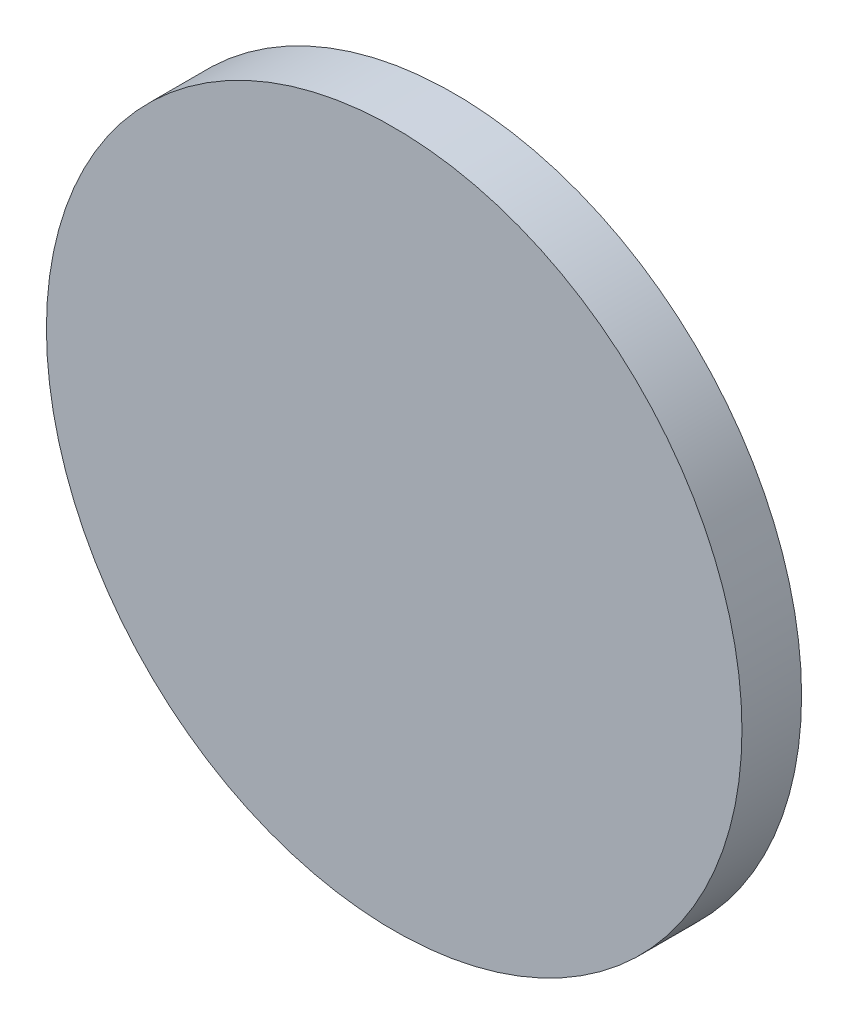
ISO-10303-21;
HEADER;
FILE_DESCRIPTION(('STEP AP214'),'2;1');
FILE_NAME('part.step','',(''),(''),'','','');
FILE_SCHEMA(('AUTOMOTIVE_DESIGN { 1 0 10303 214 1 1 1 1 }'));
ENDSEC;
DATA;
#1=APPLICATION_CONTEXT('core data for automotive mechanical design processes');
#2=APPLICATION_PROTOCOL_DEFINITION('international standard','automotive_design',2000,#1);
#3=PRODUCT_CONTEXT('',#1,'mechanical');
#4=PRODUCT('Part','Part','',(#3));
#5=PRODUCT_RELATED_PRODUCT_CATEGORY('part','',(#4));
#6=PRODUCT_DEFINITION_FORMATION('','',#4);
#7=PRODUCT_DEFINITION_CONTEXT('part definition',#1,'design');
#8=PRODUCT_DEFINITION('design','',#6,#7);
#9=PRODUCT_DEFINITION_SHAPE('','',#8);
#10=(LENGTH_UNIT() NAMED_UNIT(*) SI_UNIT(.MILLI.,.METRE.));
#11=(NAMED_UNIT(*) PLANE_ANGLE_UNIT() SI_UNIT($,.RADIAN.));
#12=(NAMED_UNIT(*) SI_UNIT($,.STERADIAN.) SOLID_ANGLE_UNIT());
#13=UNCERTAINTY_MEASURE_WITH_UNIT(LENGTH_MEASURE(1.E-05),#10,'distance_accuracy_value','');
#14=(GEOMETRIC_REPRESENTATION_CONTEXT(3) GLOBAL_UNCERTAINTY_ASSIGNED_CONTEXT((#13)) GLOBAL_UNIT_ASSIGNED_CONTEXT((#10,
#11,#12)) REPRESENTATION_CONTEXT('',''));
#15=CARTESIAN_POINT('',(0.,0.,0.));
#16=DIRECTION('',(0.,0.,1.));
#17=DIRECTION('',(1.,0.,0.));
#18=AXIS2_PLACEMENT_3D('',#15,#16,#17);
#19=CARTESIAN_POINT('',(10.65,9.818000014875,0.03429));
#20=DIRECTION('',(0.,0.,1.));
#21=DIRECTION('',(1.,0.,0.));
#22=AXIS2_PLACEMENT_3D('',#19,#20,#21);
#23=PLANE('',#22);
#24=CARTESIAN_POINT('',(10.65,9.818000014875,0.03429));
#25=DIRECTION('',(0.,0.,1.));
#26=DIRECTION('',(1.,0.,0.));
#27=AXIS2_PLACEMENT_3D('',#24,#25,#26);
#28=CIRCLE('',#27,0.200024667);
#29=CARTESIAN_POINT('',(10.850024667,9.818000014875,0.03429));
#30=VERTEX_POINT('',#29);
#31=EDGE_CURVE('E18',#30,#30,#28,.F.);
#32=ORIENTED_EDGE('',*,*,#31,.F.);
#33=EDGE_LOOP('',(#32));
#34=FACE_BOUND('',#33,.T.);
#35=ADVANCED_FACE('F15',(#34),#23,.T.);
#36=CARTESIAN_POINT('',(10.65,9.818000014875,0.));
#37=DIRECTION('',(0.,0.,1.));
#38=DIRECTION('',(1.,0.,0.));
#39=AXIS2_PLACEMENT_3D('',#36,#37,#38);
#40=CYLINDRICAL_SURFACE('',#39,0.200024667);
#41=ORIENTED_EDGE('',*,*,#31,.T.);
#42=EDGE_LOOP('',(#41));
#43=FACE_BOUND('',#42,.T.);
#44=CARTESIAN_POINT('',(10.65,9.818000014875,0.));
#45=DIRECTION('',(0.,0.,1.));
#46=DIRECTION('',(1.,0.,0.));
#47=AXIS2_PLACEMENT_3D('',#44,#45,#46);
#48=CIRCLE('',#47,0.200024667);
#49=CARTESIAN_POINT('',(10.850024667,9.818000014875,0.));
#50=VERTEX_POINT('',#49);
#51=EDGE_CURVE('E10',#50,#50,#48,.F.);
#52=ORIENTED_EDGE('',*,*,#51,.F.);
#53=EDGE_LOOP('',(#52));
#54=FACE_BOUND('',#53,.T.);
#55=ADVANCED_FACE('F27',(#43,#54),#40,.T.);
#56=CARTESIAN_POINT('',(10.65,9.818000014875,0.));
#57=DIRECTION('',(0.,0.,-1.));
#58=DIRECTION('',(-1.,0.,0.));
#59=AXIS2_PLACEMENT_3D('',#56,#57,#58);
#60=PLANE('',#59);
#61=ORIENTED_EDGE('',*,*,#51,.T.);
#62=EDGE_LOOP('',(#61));
#63=FACE_BOUND('',#62,.T.);
#64=ADVANCED_FACE('F35',(#63),#60,.T.);
#65=CLOSED_SHELL('',(#35,#55,#64));
#66=MANIFOLD_SOLID_BREP('B1',#65);
#67=ADVANCED_BREP_SHAPE_REPRESENTATION('',(#18,#66),#14);
#68=SHAPE_DEFINITION_REPRESENTATION(#9,#67);
ENDSEC;
END-ISO-10303-21;
